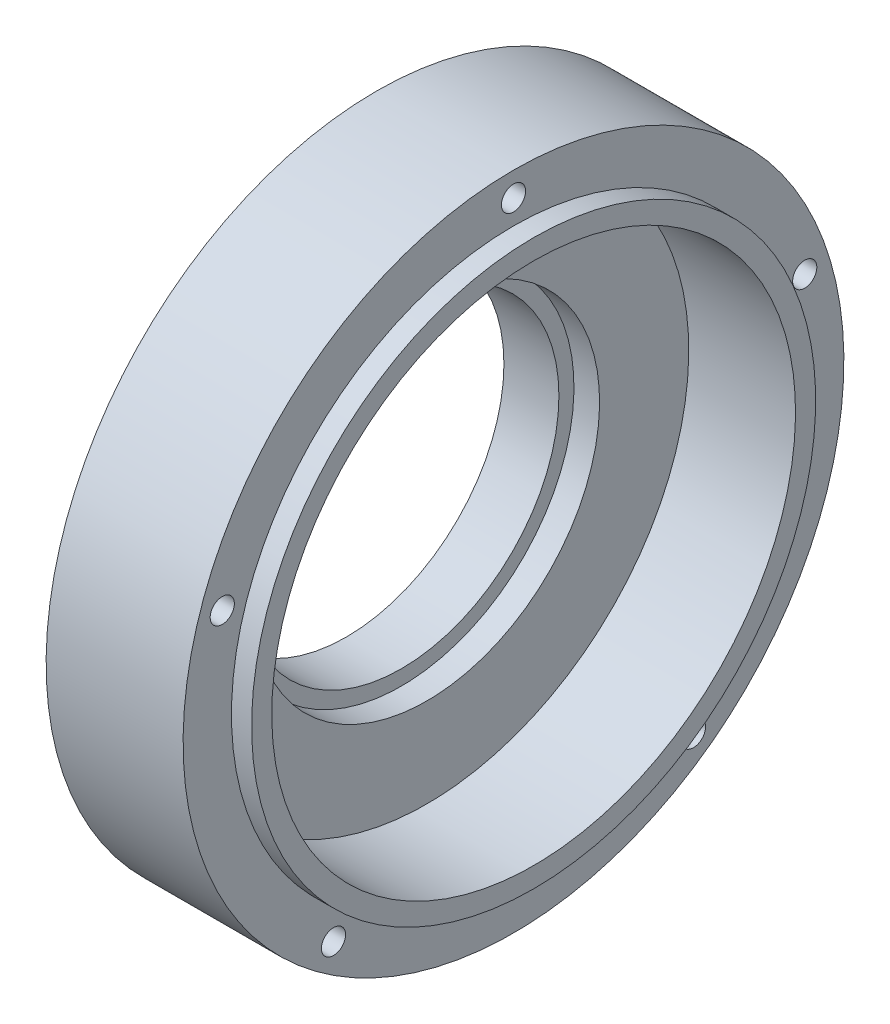
ISO-10303-21;
HEADER;
FILE_DESCRIPTION(('STEP AP214'),'2;1');
FILE_NAME('part.step','',(''),(''),'','','');
FILE_SCHEMA(('AUTOMOTIVE_DESIGN { 1 0 10303 214 1 1 1 1 }'));
ENDSEC;
DATA;
#1=APPLICATION_CONTEXT('core data for automotive mechanical design processes');
#2=APPLICATION_PROTOCOL_DEFINITION('international standard','automotive_design',2000,#1);
#3=PRODUCT_CONTEXT('',#1,'mechanical');
#4=PRODUCT('Part','Part','',(#3));
#5=PRODUCT_RELATED_PRODUCT_CATEGORY('part','',(#4));
#6=PRODUCT_DEFINITION_FORMATION('','',#4);
#7=PRODUCT_DEFINITION_CONTEXT('part definition',#1,'design');
#8=PRODUCT_DEFINITION('design','',#6,#7);
#9=PRODUCT_DEFINITION_SHAPE('','',#8);
#10=(LENGTH_UNIT() NAMED_UNIT(*) SI_UNIT(.MILLI.,.METRE.));
#11=(NAMED_UNIT(*) PLANE_ANGLE_UNIT() SI_UNIT($,.RADIAN.));
#12=(NAMED_UNIT(*) SI_UNIT($,.STERADIAN.) SOLID_ANGLE_UNIT());
#13=UNCERTAINTY_MEASURE_WITH_UNIT(LENGTH_MEASURE(1.E-05),#10,'distance_accuracy_value','');
#14=(GEOMETRIC_REPRESENTATION_CONTEXT(3) GLOBAL_UNCERTAINTY_ASSIGNED_CONTEXT((#13)) GLOBAL_UNIT_ASSIGNED_CONTEXT((#10,
#11,#12)) REPRESENTATION_CONTEXT('',''));
#15=CARTESIAN_POINT('',(0.,0.,0.));
#16=DIRECTION('',(0.,0.,1.));
#17=DIRECTION('',(1.,0.,0.));
#18=AXIS2_PLACEMENT_3D('',#15,#16,#17);
#19=CARTESIAN_POINT('',(-40.,0.,0.));
#20=DIRECTION('',(1.,0.,0.));
#21=DIRECTION('',(0.,1.,0.));
#22=AXIS2_PLACEMENT_3D('',#19,#20,#21);
#23=PLANE('',#22);
#24=CARTESIAN_POINT('',(-40.,0.,0.));
#25=DIRECTION('',(1.,0.,0.));
#26=DIRECTION('',(0.,1.,0.));
#27=AXIS2_PLACEMENT_3D('',#24,#25,#26);
#28=CIRCLE('',#27,88.25);
#29=CARTESIAN_POINT('',(-40.,88.25,0.));
#30=VERTEX_POINT('',#29);
#31=EDGE_CURVE('E77',#30,#30,#28,.T.);
#32=ORIENTED_EDGE('',*,*,#31,.F.);
#33=EDGE_LOOP('',(#32));
#34=FACE_BOUND('',#33,.T.);
#35=CARTESIAN_POINT('',(-40.,0.,0.));
#36=DIRECTION('',(1.,0.,0.));
#37=DIRECTION('',(0.,1.,0.));
#38=AXIS2_PLACEMENT_3D('',#35,#36,#37);
#39=CIRCLE('',#38,78.25);
#40=CARTESIAN_POINT('',(-40.,78.25,0.));
#41=VERTEX_POINT('',#40);
#42=EDGE_CURVE('E44',#41,#41,#39,.T.);
#43=ORIENTED_EDGE('',*,*,#42,.T.);
#44=EDGE_LOOP('',(#43));
#45=FACE_BOUND('',#44,.T.);
#46=ADVANCED_FACE('F33',(#34,#45),#23,.F.);
#47=CARTESIAN_POINT('',(100.288511213782,0.,0.));
#48=DIRECTION('',(1.,0.,0.));
#49=DIRECTION('',(0.,1.,0.));
#50=AXIS2_PLACEMENT_3D('',#47,#48,#49);
#51=CYLINDRICAL_SURFACE('',#50,78.25);
#52=CARTESIAN_POINT('',(-12.7,0.,0.));
#53=DIRECTION('',(1.,0.,0.));
#54=DIRECTION('',(0.,1.,0.));
#55=AXIS2_PLACEMENT_3D('',#52,#53,#54);
#56=CIRCLE('',#55,78.25);
#57=CARTESIAN_POINT('',(-12.7,78.25,0.));
#58=VERTEX_POINT('',#57);
#59=EDGE_CURVE('E48',#58,#58,#56,.T.);
#60=ORIENTED_EDGE('',*,*,#59,.T.);
#61=EDGE_LOOP('',(#60));
#62=FACE_BOUND('',#61,.T.);
#63=ORIENTED_EDGE('',*,*,#42,.F.);
#64=EDGE_LOOP('',(#63));
#65=FACE_BOUND('',#64,.T.);
#66=ADVANCED_FACE('F148',(#62,#65),#51,.F.);
#67=CARTESIAN_POINT('',(-12.7,0.,0.));
#68=DIRECTION('',(-1.,0.,0.));
#69=DIRECTION('',(0.,-1.,0.));
#70=AXIS2_PLACEMENT_3D('',#67,#68,#69);
#71=PLANE('',#70);
#72=ORIENTED_EDGE('',*,*,#59,.F.);
#73=EDGE_LOOP('',(#72));
#74=FACE_BOUND('',#73,.T.);
#75=CARTESIAN_POINT('',(-12.7,0.,0.));
#76=DIRECTION('',(1.,0.,0.));
#77=DIRECTION('',(0.,1.,0.));
#78=AXIS2_PLACEMENT_3D('',#75,#76,#77);
#79=CIRCLE('',#78,85.73);
#80=CARTESIAN_POINT('',(-12.7,85.73,0.));
#81=VERTEX_POINT('',#80);
#82=EDGE_CURVE('E53',#81,#81,#79,.T.);
#83=ORIENTED_EDGE('',*,*,#82,.T.);
#84=EDGE_LOOP('',(#83));
#85=FACE_BOUND('',#84,.T.);
#86=ADVANCED_FACE('F153',(#74,#85),#71,.F.);
#87=CARTESIAN_POINT('',(100.288511213782,0.,0.));
#88=DIRECTION('',(1.,0.,0.));
#89=DIRECTION('',(0.,1.,0.));
#90=AXIS2_PLACEMENT_3D('',#87,#88,#89);
#91=CYLINDRICAL_SURFACE('',#90,85.73);
#92=ORIENTED_EDGE('',*,*,#82,.F.);
#93=EDGE_LOOP('',(#92));
#94=FACE_BOUND('',#93,.T.);
#95=CARTESIAN_POINT('',(0.,0.,0.));
#96=DIRECTION('',(1.,0.,0.));
#97=DIRECTION('',(0.,1.,0.));
#98=AXIS2_PLACEMENT_3D('',#95,#96,#97);
#99=CIRCLE('',#98,85.73);
#100=CARTESIAN_POINT('',(0.,85.73,0.));
#101=VERTEX_POINT('',#100);
#102=EDGE_CURVE('E56',#101,#101,#99,.T.);
#103=ORIENTED_EDGE('',*,*,#102,.T.);
#104=EDGE_LOOP('',(#103));
#105=FACE_BOUND('',#104,.T.);
#106=ADVANCED_FACE('F161',(#94,#105),#91,.F.);
#107=CARTESIAN_POINT('',(0.,0.,0.));
#108=DIRECTION('',(-1.,0.,0.));
#109=DIRECTION('',(0.,-1.,0.));
#110=AXIS2_PLACEMENT_3D('',#107,#108,#109);
#111=PLANE('',#110);
#112=ORIENTED_EDGE('',*,*,#102,.F.);
#113=EDGE_LOOP('',(#112));
#114=FACE_BOUND('',#113,.T.);
#115=CARTESIAN_POINT('',(0.,0.,0.));
#116=DIRECTION('',(1.,0.,0.));
#117=DIRECTION('',(0.,1.,0.));
#118=AXIS2_PLACEMENT_3D('',#115,#116,#117);
#119=CIRCLE('',#118,130.);
#120=CARTESIAN_POINT('',(0.,130.,0.));
#121=VERTEX_POINT('',#120);
#122=EDGE_CURVE('E59',#121,#121,#119,.T.);
#123=ORIENTED_EDGE('',*,*,#122,.T.);
#124=EDGE_LOOP('',(#123));
#125=FACE_BOUND('',#124,.T.);
#126=ADVANCED_FACE('F165',(#114,#125),#111,.F.);
#127=CARTESIAN_POINT('',(100.288511213782,0.,0.));
#128=DIRECTION('',(1.,0.,0.));
#129=DIRECTION('',(0.,1.,0.));
#130=AXIS2_PLACEMENT_3D('',#127,#128,#129);
#131=CYLINDRICAL_SURFACE('',#130,130.);
#132=ORIENTED_EDGE('',*,*,#122,.F.);
#133=EDGE_LOOP('',(#132));
#134=FACE_BOUND('',#133,.T.);
#135=CARTESIAN_POINT('',(53.,0.,0.));
#136=DIRECTION('',(1.,0.,0.));
#137=DIRECTION('',(0.,1.,0.));
#138=AXIS2_PLACEMENT_3D('',#135,#136,#137);
#139=CIRCLE('',#138,130.);
#140=CARTESIAN_POINT('',(53.,130.,0.));
#141=VERTEX_POINT('',#140);
#142=EDGE_CURVE('E62',#141,#141,#139,.T.);
#143=ORIENTED_EDGE('',*,*,#142,.T.);
#144=EDGE_LOOP('',(#143));
#145=FACE_BOUND('',#144,.T.);
#146=ADVANCED_FACE('F169',(#134,#145),#131,.F.);
#147=CARTESIAN_POINT('',(53.,0.,0.));
#148=DIRECTION('',(1.,0.,0.));
#149=DIRECTION('',(0.,1.,0.));
#150=AXIS2_PLACEMENT_3D('',#147,#148,#149);
#151=PLANE('',#150);
#152=CARTESIAN_POINT('',(53.,0.,0.));
#153=DIRECTION('',(1.,0.,0.));
#154=DIRECTION('',(0.,1.,0.));
#155=AXIS2_PLACEMENT_3D('',#152,#153,#154);
#156=CIRCLE('',#155,140.);
#157=CARTESIAN_POINT('',(53.,140.,0.));
#158=VERTEX_POINT('',#157);
#159=EDGE_CURVE('E65',#158,#158,#156,.T.);
#160=ORIENTED_EDGE('',*,*,#159,.T.);
#161=EDGE_LOOP('',(#160));
#162=FACE_BOUND('',#161,.T.);
#163=ORIENTED_EDGE('',*,*,#142,.F.);
#164=EDGE_LOOP('',(#163));
#165=FACE_BOUND('',#164,.T.);
#166=ADVANCED_FACE('F173',(#162,#165),#151,.T.);
#167=CARTESIAN_POINT('',(100.288511213782,0.,0.));
#168=DIRECTION('',(1.,0.,0.));
#169=DIRECTION('',(0.,1.,0.));
#170=AXIS2_PLACEMENT_3D('',#167,#168,#169);
#171=CYLINDRICAL_SURFACE('',#170,140.);
#172=CARTESIAN_POINT('',(43.,0.,0.));
#173=DIRECTION('',(1.,0.,0.));
#174=DIRECTION('',(0.,1.,0.));
#175=AXIS2_PLACEMENT_3D('',#172,#173,#174);
#176=CIRCLE('',#175,140.);
#177=CARTESIAN_POINT('',(43.,140.,0.));
#178=VERTEX_POINT('',#177);
#179=EDGE_CURVE('E68',#178,#178,#176,.T.);
#180=ORIENTED_EDGE('',*,*,#179,.T.);
#181=EDGE_LOOP('',(#180));
#182=FACE_BOUND('',#181,.T.);
#183=ORIENTED_EDGE('',*,*,#159,.F.);
#184=EDGE_LOOP('',(#183));
#185=FACE_BOUND('',#184,.T.);
#186=ADVANCED_FACE('F117',(#182,#185),#171,.T.);
#187=CARTESIAN_POINT('',(43.,0.,0.));
#188=DIRECTION('',(-1.,0.,0.));
#189=DIRECTION('',(0.,-1.,0.));
#190=AXIS2_PLACEMENT_3D('',#187,#188,#189);
#191=PLANE('',#190);
#192=CARTESIAN_POINT('',(43.,46.9705831449916,144.560590476863));
#193=DIRECTION('',(1.,0.,0.));
#194=DIRECTION('',(0.,0.309016994374945,0.951056516295155));
#195=AXIS2_PLACEMENT_3D('',#192,#193,#194);
#196=CIRCLE('',#195,6.);
#197=CARTESIAN_POINT('',(43.,48.8246851112413,150.266929574634));
#198=VERTEX_POINT('',#197);
#199=EDGE_CURVE('E103',#198,#198,#196,.T.);
#200=ORIENTED_EDGE('',*,*,#199,.F.);
#201=EDGE_LOOP('',(#200));
#202=FACE_BOUND('',#201,.T.);
#203=CARTESIAN_POINT('',(43.,-122.970583144993,89.3433583484552));
#204=DIRECTION('',(1.,0.,0.));
#205=DIRECTION('',(0.,-0.809016994374951,0.587785252292469));
#206=AXIS2_PLACEMENT_3D('',#203,#204,#205);
#207=CIRCLE('',#206,6.);
#208=CARTESIAN_POINT('',(43.,-127.824685111242,92.87006986221));
#209=VERTEX_POINT('',#208);
#210=EDGE_CURVE('E97',#209,#209,#207,.T.);
#211=ORIENTED_EDGE('',*,*,#210,.F.);
#212=EDGE_LOOP('',(#211));
#213=FACE_BOUND('',#212,.T.);
#214=CARTESIAN_POINT('',(43.,-122.970583144991,-89.343358348457));
#215=DIRECTION('',(1.,0.,0.));
#216=DIRECTION('',(0.,-0.809016994374942,-0.58778525229248));
#217=AXIS2_PLACEMENT_3D('',#214,#215,#216);
#218=CIRCLE('',#217,6.);
#219=CARTESIAN_POINT('',(43.,-127.824685111241,-92.8700698622119));
#220=VERTEX_POINT('',#219);
#221=EDGE_CURVE('E90',#220,#220,#218,.T.);
#222=ORIENTED_EDGE('',*,*,#221,.F.);
#223=EDGE_LOOP('',(#222));
#224=FACE_BOUND('',#223,.T.);
#225=CARTESIAN_POINT('',(43.,46.9705831449936,-144.560590476863));
#226=DIRECTION('',(1.,0.,0.));
#227=DIRECTION('',(0.,0.309016994374958,-0.95105651629515));
#228=AXIS2_PLACEMENT_3D('',#225,#226,#227);
#229=CIRCLE('',#228,6.);
#230=CARTESIAN_POINT('',(43.,48.8246851112434,-150.266929574634));
#231=VERTEX_POINT('',#230);
#232=EDGE_CURVE('E91',#231,#231,#229,.T.);
#233=ORIENTED_EDGE('',*,*,#232,.F.);
#234=EDGE_LOOP('',(#233));
#235=FACE_BOUND('',#234,.T.);
#236=CARTESIAN_POINT('',(43.,152.,0.));
#237=DIRECTION('',(1.,0.,0.));
#238=DIRECTION('',(0.,1.,0.));
#239=AXIS2_PLACEMENT_3D('',#236,#237,#238);
#240=CIRCLE('',#239,6.);
#241=CARTESIAN_POINT('',(43.,158.,0.));
#242=VERTEX_POINT('',#241);
#243=EDGE_CURVE('E83',#242,#242,#240,.T.);
#244=ORIENTED_EDGE('',*,*,#243,.F.);
#245=EDGE_LOOP('',(#244));
#246=FACE_BOUND('',#245,.T.);
#247=ORIENTED_EDGE('',*,*,#179,.F.);
#248=EDGE_LOOP('',(#247));
#249=FACE_BOUND('',#248,.T.);
#250=CARTESIAN_POINT('',(43.,0.,0.));
#251=DIRECTION('',(1.,0.,0.));
#252=DIRECTION('',(0.,1.,0.));
#253=AXIS2_PLACEMENT_3D('',#250,#251,#252);
#254=CIRCLE('',#253,164.);
#255=CARTESIAN_POINT('',(43.,164.,0.));
#256=VERTEX_POINT('',#255);
#257=EDGE_CURVE('E71',#256,#256,#254,.T.);
#258=ORIENTED_EDGE('',*,*,#257,.T.);
#259=EDGE_LOOP('',(#258));
#260=FACE_BOUND('',#259,.T.);
#261=ADVANCED_FACE('F113',(#202,#213,#224,#235,#246,#249,#260),#191,.F.);
#262=CARTESIAN_POINT('',(100.288511213782,0.,0.));
#263=DIRECTION('',(1.,0.,0.));
#264=DIRECTION('',(0.,1.,0.));
#265=AXIS2_PLACEMENT_3D('',#262,#263,#264);
#266=CYLINDRICAL_SURFACE('',#265,164.);
#267=ORIENTED_EDGE('',*,*,#257,.F.);
#268=EDGE_LOOP('',(#267));
#269=FACE_BOUND('',#268,.T.);
#270=CARTESIAN_POINT('',(-25.,0.,0.));
#271=DIRECTION('',(1.,0.,0.));
#272=DIRECTION('',(0.,1.,0.));
#273=AXIS2_PLACEMENT_3D('',#270,#271,#272);
#274=CIRCLE('',#273,164.);
#275=CARTESIAN_POINT('',(-25.,164.,0.));
#276=VERTEX_POINT('',#275);
#277=EDGE_CURVE('E74',#276,#276,#274,.T.);
#278=ORIENTED_EDGE('',*,*,#277,.T.);
#279=EDGE_LOOP('',(#278));
#280=FACE_BOUND('',#279,.T.);
#281=ADVANCED_FACE('F116',(#269,#280),#266,.T.);
#282=CARTESIAN_POINT('',(-25.,0.,0.));
#283=DIRECTION('',(1.,0.,0.));
#284=DIRECTION('',(0.,1.,0.));
#285=AXIS2_PLACEMENT_3D('',#282,#283,#284);
#286=PLANE('',#285);
#287=CARTESIAN_POINT('',(-25.,46.9705831449916,144.560590476863));
#288=DIRECTION('',(1.,0.,0.));
#289=DIRECTION('',(0.,1.,0.));
#290=AXIS2_PLACEMENT_3D('',#287,#288,#289);
#291=CIRCLE('',#290,6.);
#292=CARTESIAN_POINT('',(-25.,52.9705831449916,144.560590476863));
#293=VERTEX_POINT('',#292);
#294=EDGE_CURVE('E86',#293,#293,#291,.F.);
#295=ORIENTED_EDGE('',*,*,#294,.F.);
#296=EDGE_LOOP('',(#295));
#297=FACE_BOUND('',#296,.T.);
#298=CARTESIAN_POINT('',(-25.,-122.970583144993,89.3433583484552));
#299=DIRECTION('',(1.,0.,0.));
#300=DIRECTION('',(0.,1.,0.));
#301=AXIS2_PLACEMENT_3D('',#298,#299,#300);
#302=CIRCLE('',#301,6.);
#303=CARTESIAN_POINT('',(-25.,-116.970583144993,89.3433583484552));
#304=VERTEX_POINT('',#303);
#305=EDGE_CURVE('E100',#304,#304,#302,.F.);
#306=ORIENTED_EDGE('',*,*,#305,.F.);
#307=EDGE_LOOP('',(#306));
#308=FACE_BOUND('',#307,.T.);
#309=CARTESIAN_POINT('',(-25.,-122.970583144991,-89.343358348457));
#310=DIRECTION('',(1.,0.,0.));
#311=DIRECTION('',(0.,1.,0.));
#312=AXIS2_PLACEMENT_3D('',#309,#310,#311);
#313=CIRCLE('',#312,6.);
#314=CARTESIAN_POINT('',(-25.,-116.970583144991,-89.343358348457));
#315=VERTEX_POINT('',#314);
#316=EDGE_CURVE('E94',#315,#315,#313,.F.);
#317=ORIENTED_EDGE('',*,*,#316,.F.);
#318=EDGE_LOOP('',(#317));
#319=FACE_BOUND('',#318,.T.);
#320=CARTESIAN_POINT('',(-25.,46.9705831449936,-144.560590476863));
#321=DIRECTION('',(1.,0.,0.));
#322=DIRECTION('',(0.,1.,0.));
#323=AXIS2_PLACEMENT_3D('',#320,#321,#322);
#324=CIRCLE('',#323,6.);
#325=CARTESIAN_POINT('',(-25.,52.9705831449936,-144.560590476863));
#326=VERTEX_POINT('',#325);
#327=EDGE_CURVE('E87',#326,#326,#324,.F.);
#328=ORIENTED_EDGE('',*,*,#327,.F.);
#329=EDGE_LOOP('',(#328));
#330=FACE_BOUND('',#329,.T.);
#331=CARTESIAN_POINT('',(-25.,152.,0.));
#332=DIRECTION('',(1.,0.,0.));
#333=DIRECTION('',(0.,1.,0.));
#334=AXIS2_PLACEMENT_3D('',#331,#332,#333);
#335=CIRCLE('',#334,6.);
#336=CARTESIAN_POINT('',(-25.,158.,0.));
#337=VERTEX_POINT('',#336);
#338=EDGE_CURVE('E80',#337,#337,#335,.F.);
#339=ORIENTED_EDGE('',*,*,#338,.F.);
#340=EDGE_LOOP('',(#339));
#341=FACE_BOUND('',#340,.T.);
#342=CARTESIAN_POINT('',(-25.,0.,0.));
#343=DIRECTION('',(1.,0.,0.));
#344=DIRECTION('',(0.,1.,0.));
#345=AXIS2_PLACEMENT_3D('',#342,#343,#344);
#346=CIRCLE('',#345,93.25);
#347=CARTESIAN_POINT('',(-25.,93.25,0.));
#348=VERTEX_POINT('',#347);
#349=EDGE_CURVE('E40',#348,#348,#346,.T.);
#350=ORIENTED_EDGE('',*,*,#349,.T.);
#351=EDGE_LOOP('',(#350));
#352=FACE_BOUND('',#351,.T.);
#353=ORIENTED_EDGE('',*,*,#277,.F.);
#354=EDGE_LOOP('',(#353));
#355=FACE_BOUND('',#354,.T.);
#356=ADVANCED_FACE('F133',(#297,#308,#319,#330,#341,#352,#355),#286,.F.);
#357=CARTESIAN_POINT('',(100.288511213782,0.,0.));
#358=DIRECTION('',(1.,0.,0.));
#359=DIRECTION('',(0.,1.,0.));
#360=AXIS2_PLACEMENT_3D('',#357,#358,#359);
#361=CYLINDRICAL_SURFACE('',#360,88.25);
#362=CARTESIAN_POINT('',(-30.,0.,0.));
#363=DIRECTION('',(1.,0.,0.));
#364=DIRECTION('',(0.,1.,0.));
#365=AXIS2_PLACEMENT_3D('',#362,#363,#364);
#366=CIRCLE('',#365,88.25);
#367=CARTESIAN_POINT('',(-30.,88.25,0.));
#368=VERTEX_POINT('',#367);
#369=EDGE_CURVE('E10',#368,#368,#366,.F.);
#370=ORIENTED_EDGE('',*,*,#369,.T.);
#371=EDGE_LOOP('',(#370));
#372=FACE_BOUND('',#371,.T.);
#373=ORIENTED_EDGE('',*,*,#31,.T.);
#374=EDGE_LOOP('',(#373));
#375=FACE_BOUND('',#374,.T.);
#376=ADVANCED_FACE('F138',(#372,#375),#361,.T.);
#377=CARTESIAN_POINT('',(-30.,0.,0.));
#378=DIRECTION('',(1.,0.,0.));
#379=DIRECTION('',(0.,1.,0.));
#380=AXIS2_PLACEMENT_3D('',#377,#378,#379);
#381=TOROIDAL_SURFACE('',#380,93.25,5.);
#382=ORIENTED_EDGE('',*,*,#369,.F.);
#383=EDGE_LOOP('',(#382));
#384=FACE_BOUND('',#383,.T.);
#385=ORIENTED_EDGE('',*,*,#349,.F.);
#386=EDGE_LOOP('',(#385));
#387=FACE_BOUND('',#386,.T.);
#388=ADVANCED_FACE('F35',(#384,#387),#381,.F.);
#389=CARTESIAN_POINT('',(-41.9705627484772,152.,0.));
#390=DIRECTION('',(1.,0.,0.));
#391=DIRECTION('',(0.,1.,0.));
#392=AXIS2_PLACEMENT_3D('',#389,#390,#391);
#393=CYLINDRICAL_SURFACE('',#392,6.);
#394=ORIENTED_EDGE('',*,*,#338,.T.);
#395=EDGE_LOOP('',(#394));
#396=FACE_BOUND('',#395,.T.);
#397=ORIENTED_EDGE('',*,*,#243,.T.);
#398=EDGE_LOOP('',(#397));
#399=FACE_BOUND('',#398,.T.);
#400=ADVANCED_FACE('F213',(#396,#399),#393,.F.);
#401=CARTESIAN_POINT('',(-41.9705627484772,46.9705831449936,-144.560590476863));
#402=DIRECTION('',(1.,0.,0.));
#403=DIRECTION('',(0.,1.,0.));
#404=AXIS2_PLACEMENT_3D('',#401,#402,#403);
#405=CYLINDRICAL_SURFACE('',#404,6.);
#406=ORIENTED_EDGE('',*,*,#327,.T.);
#407=EDGE_LOOP('',(#406));
#408=FACE_BOUND('',#407,.T.);
#409=ORIENTED_EDGE('',*,*,#232,.T.);
#410=EDGE_LOOP('',(#409));
#411=FACE_BOUND('',#410,.T.);
#412=ADVANCED_FACE('F221',(#408,#411),#405,.F.);
#413=CARTESIAN_POINT('',(-41.9705627484772,-122.970583144991,-89.343358348457));
#414=DIRECTION('',(1.,0.,0.));
#415=DIRECTION('',(0.,1.,0.));
#416=AXIS2_PLACEMENT_3D('',#413,#414,#415);
#417=CYLINDRICAL_SURFACE('',#416,6.);
#418=ORIENTED_EDGE('',*,*,#316,.T.);
#419=EDGE_LOOP('',(#418));
#420=FACE_BOUND('',#419,.T.);
#421=ORIENTED_EDGE('',*,*,#221,.T.);
#422=EDGE_LOOP('',(#421));
#423=FACE_BOUND('',#422,.T.);
#424=ADVANCED_FACE('F232',(#420,#423),#417,.F.);
#425=CARTESIAN_POINT('',(-41.9705627484771,-122.970583144993,89.3433583484552));
#426=DIRECTION('',(1.,0.,0.));
#427=DIRECTION('',(0.,1.,0.));
#428=AXIS2_PLACEMENT_3D('',#425,#426,#427);
#429=CYLINDRICAL_SURFACE('',#428,6.);
#430=ORIENTED_EDGE('',*,*,#305,.T.);
#431=EDGE_LOOP('',(#430));
#432=FACE_BOUND('',#431,.T.);
#433=ORIENTED_EDGE('',*,*,#210,.T.);
#434=EDGE_LOOP('',(#433));
#435=FACE_BOUND('',#434,.T.);
#436=ADVANCED_FACE('F239',(#432,#435),#429,.F.);
#437=CARTESIAN_POINT('',(-41.9705627484772,46.9705831449916,144.560590476863));
#438=DIRECTION('',(1.,0.,0.));
#439=DIRECTION('',(0.,1.,0.));
#440=AXIS2_PLACEMENT_3D('',#437,#438,#439);
#441=CYLINDRICAL_SURFACE('',#440,6.);
#442=ORIENTED_EDGE('',*,*,#294,.T.);
#443=EDGE_LOOP('',(#442));
#444=FACE_BOUND('',#443,.T.);
#445=ORIENTED_EDGE('',*,*,#199,.T.);
#446=EDGE_LOOP('',(#445));
#447=FACE_BOUND('',#446,.T.);
#448=ADVANCED_FACE('F111',(#444,#447),#441,.F.);
#449=CLOSED_SHELL('',(#46,#66,#86,#106,#126,#146,#166,#186,#261,#281,#356,#376,#388,#400,#412,
#424,#436,#448));
#450=MANIFOLD_SOLID_BREP('B2',#449);
#451=ADVANCED_BREP_SHAPE_REPRESENTATION('',(#18,#450),#14);
#452=SHAPE_DEFINITION_REPRESENTATION(#9,#451);
ENDSEC;
END-ISO-10303-21;
